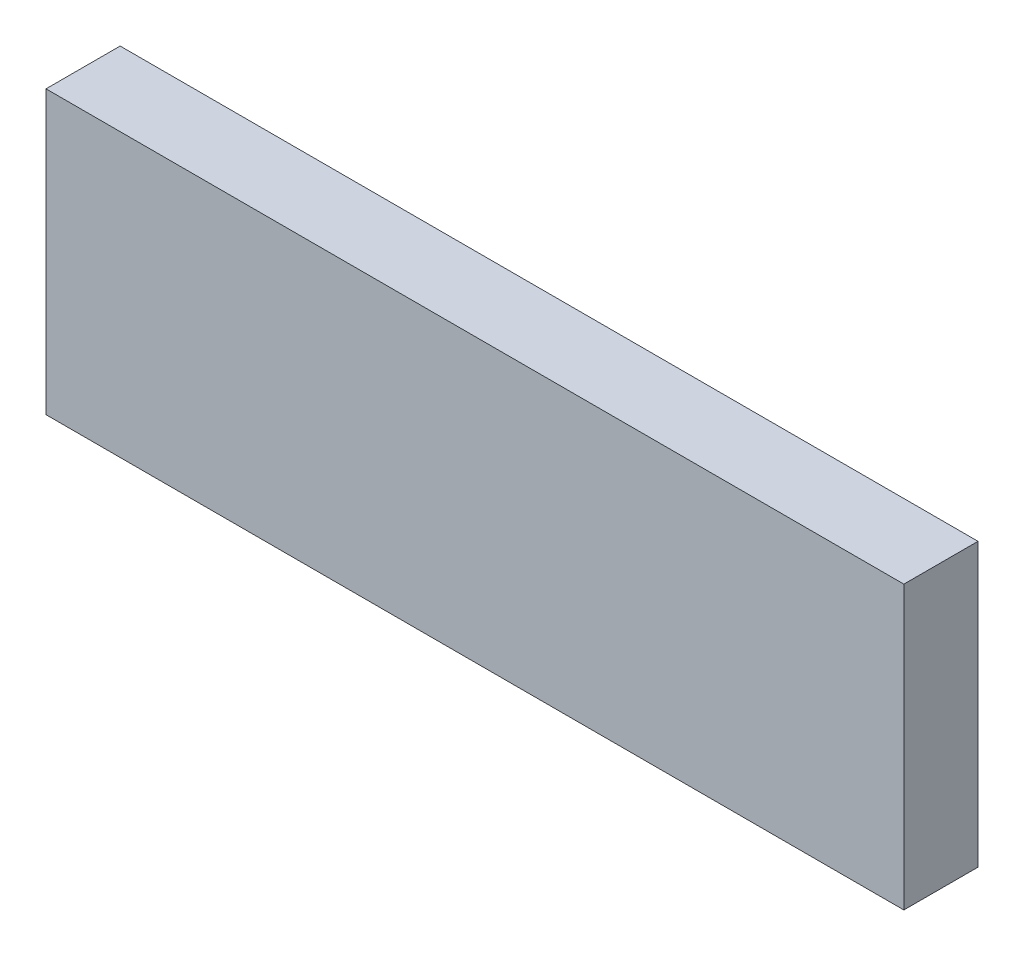
ISO-10303-21;
HEADER;
FILE_DESCRIPTION(('STEP AP214'),'2;1');
FILE_NAME('part.step','',(''),(''),'','','');
FILE_SCHEMA(('AUTOMOTIVE_DESIGN { 1 0 10303 214 1 1 1 1 }'));
ENDSEC;
DATA;
#1=APPLICATION_CONTEXT('core data for automotive mechanical design processes');
#2=APPLICATION_PROTOCOL_DEFINITION('international standard','automotive_design',2000,#1);
#3=PRODUCT_CONTEXT('',#1,'mechanical');
#4=PRODUCT('Part','Part','',(#3));
#5=PRODUCT_RELATED_PRODUCT_CATEGORY('part','',(#4));
#6=PRODUCT_DEFINITION_FORMATION('','',#4);
#7=PRODUCT_DEFINITION_CONTEXT('part definition',#1,'design');
#8=PRODUCT_DEFINITION('design','',#6,#7);
#9=PRODUCT_DEFINITION_SHAPE('','',#8);
#10=(LENGTH_UNIT() NAMED_UNIT(*) SI_UNIT(.MILLI.,.METRE.));
#11=(NAMED_UNIT(*) PLANE_ANGLE_UNIT() SI_UNIT($,.RADIAN.));
#12=(NAMED_UNIT(*) SI_UNIT($,.STERADIAN.) SOLID_ANGLE_UNIT());
#13=UNCERTAINTY_MEASURE_WITH_UNIT(LENGTH_MEASURE(1.E-05),#10,'distance_accuracy_value','');
#14=(GEOMETRIC_REPRESENTATION_CONTEXT(3) GLOBAL_UNCERTAINTY_ASSIGNED_CONTEXT((#13)) GLOBAL_UNIT_ASSIGNED_CONTEXT((#10,
#11,#12)) REPRESENTATION_CONTEXT('',''));
#15=CARTESIAN_POINT('',(0.,0.,0.));
#16=DIRECTION('',(0.,0.,1.));
#17=DIRECTION('',(1.,0.,0.));
#18=AXIS2_PLACEMENT_3D('',#15,#16,#17);
#19=CARTESIAN_POINT('',(-112.34,36.9570000000001,258.48464725068));
#20=DIRECTION('',(1.,0.,0.));
#21=DIRECTION('',(0.,0.,-1.));
#22=AXIS2_PLACEMENT_3D('',#19,#20,#21);
#23=PLANE('',#22);
#24=DIRECTION('',(0.,-1.,0.));
#25=VECTOR('',#24,1.);
#26=CARTESIAN_POINT('',(-112.34,36.9570000000001,19.419000024));
#27=LINE('',#26,#25);
#28=CARTESIAN_POINT('',(-112.34,36.9570000000001,19.419000024));
#29=VERTEX_POINT('',#28);
#30=CARTESIAN_POINT('',(-112.34,-36.9570000000001,19.419000024));
#31=VERTEX_POINT('',#30);
#32=EDGE_CURVE('E83',#29,#31,#27,.T.);
#33=ORIENTED_EDGE('',*,*,#32,.F.);
#34=DIRECTION('',(0.,0.,-1.));
#35=VECTOR('',#34,1.);
#36=CARTESIAN_POINT('',(-112.34,36.9570000000001,258.48464725068));
#37=LINE('',#36,#35);
#38=CARTESIAN_POINT('',(-112.34,36.9570000000001,0.));
#39=VERTEX_POINT('',#38);
#40=EDGE_CURVE('E37',#29,#39,#37,.T.);
#41=ORIENTED_EDGE('',*,*,#40,.T.);
#42=DIRECTION('',(0.,-1.,0.));
#43=VECTOR('',#42,1.);
#44=CARTESIAN_POINT('',(-112.34,36.9570000000001,0.));
#45=LINE('',#44,#43);
#46=CARTESIAN_POINT('',(-112.34,-36.9570000000001,0.));
#47=VERTEX_POINT('',#46);
#48=EDGE_CURVE('E81',#39,#47,#45,.T.);
#49=ORIENTED_EDGE('',*,*,#48,.T.);
#50=DIRECTION('',(0.,0.,-1.));
#51=VECTOR('',#50,1.);
#52=CARTESIAN_POINT('',(-112.34,-36.9570000000001,258.48464725068));
#53=LINE('',#52,#51);
#54=EDGE_CURVE('E72',#31,#47,#53,.T.);
#55=ORIENTED_EDGE('',*,*,#54,.F.);
#56=EDGE_LOOP('',(#33,#41,#49,#55));
#57=FACE_BOUND('',#56,.T.);
#58=ADVANCED_FACE('F33',(#57),#23,.F.);
#59=CARTESIAN_POINT('',(-112.34,-36.9570000000001,258.48464725068));
#60=DIRECTION('',(0.,1.,0.));
#61=DIRECTION('',(0.,0.,1.));
#62=AXIS2_PLACEMENT_3D('',#59,#60,#61);
#63=PLANE('',#62);
#64=DIRECTION('',(1.,0.,0.));
#65=VECTOR('',#64,1.);
#66=CARTESIAN_POINT('',(-112.34,-36.9570000000001,19.419000024));
#67=LINE('',#66,#65);
#68=CARTESIAN_POINT('',(112.34,-36.9570000000001,19.419000024));
#69=VERTEX_POINT('',#68);
#70=EDGE_CURVE('E42',#31,#69,#67,.T.);
#71=ORIENTED_EDGE('',*,*,#70,.F.);
#72=ORIENTED_EDGE('',*,*,#54,.T.);
#73=DIRECTION('',(1.,0.,0.));
#74=VECTOR('',#73,1.);
#75=CARTESIAN_POINT('',(-112.34,-36.9570000000001,0.));
#76=LINE('',#75,#74);
#77=CARTESIAN_POINT('',(112.34,-36.9570000000001,0.));
#78=VERTEX_POINT('',#77);
#79=EDGE_CURVE('E93',#47,#78,#76,.T.);
#80=ORIENTED_EDGE('',*,*,#79,.T.);
#81=DIRECTION('',(0.,0.,-1.));
#82=VECTOR('',#81,1.);
#83=CARTESIAN_POINT('',(112.34,-36.9570000000001,258.48464725068));
#84=LINE('',#83,#82);
#85=EDGE_CURVE('E102',#69,#78,#84,.T.);
#86=ORIENTED_EDGE('',*,*,#85,.F.);
#87=EDGE_LOOP('',(#71,#72,#80,#86));
#88=FACE_BOUND('',#87,.T.);
#89=ADVANCED_FACE('F106',(#88),#63,.F.);
#90=CARTESIAN_POINT('',(112.34,36.9570000000001,258.48464725068));
#91=DIRECTION('',(-1.,0.,0.));
#92=DIRECTION('',(0.,0.,1.));
#93=AXIS2_PLACEMENT_3D('',#90,#91,#92);
#94=PLANE('',#93);
#95=DIRECTION('',(0.,1.,0.));
#96=VECTOR('',#95,1.);
#97=CARTESIAN_POINT('',(112.34,36.9570000000001,19.419000024));
#98=LINE('',#97,#96);
#99=CARTESIAN_POINT('',(112.34,36.9570000000001,19.419000024));
#100=VERTEX_POINT('',#99);
#101=EDGE_CURVE('E11',#69,#100,#98,.T.);
#102=ORIENTED_EDGE('',*,*,#101,.F.);
#103=ORIENTED_EDGE('',*,*,#85,.T.);
#104=DIRECTION('',(0.,1.,0.));
#105=VECTOR('',#104,1.);
#106=CARTESIAN_POINT('',(112.34,36.9570000000001,0.));
#107=LINE('',#106,#105);
#108=CARTESIAN_POINT('',(112.34,36.9570000000001,0.));
#109=VERTEX_POINT('',#108);
#110=EDGE_CURVE('E103',#78,#109,#107,.T.);
#111=ORIENTED_EDGE('',*,*,#110,.T.);
#112=DIRECTION('',(0.,0.,-1.));
#113=VECTOR('',#112,1.);
#114=CARTESIAN_POINT('',(112.34,36.9570000000001,258.48464725068));
#115=LINE('',#114,#113);
#116=EDGE_CURVE('E55',#100,#109,#115,.T.);
#117=ORIENTED_EDGE('',*,*,#116,.F.);
#118=EDGE_LOOP('',(#102,#103,#111,#117));
#119=FACE_BOUND('',#118,.T.);
#120=ADVANCED_FACE('F105',(#119),#94,.F.);
#121=CARTESIAN_POINT('',(-112.34,36.9570000000001,258.48464725068));
#122=DIRECTION('',(0.,-1.,0.));
#123=DIRECTION('',(0.,0.,-1.));
#124=AXIS2_PLACEMENT_3D('',#121,#122,#123);
#125=PLANE('',#124);
#126=DIRECTION('',(-1.,0.,0.));
#127=VECTOR('',#126,1.);
#128=CARTESIAN_POINT('',(-112.34,36.9570000000001,19.419000024));
#129=LINE('',#128,#127);
#130=EDGE_CURVE('E90',#100,#29,#129,.T.);
#131=ORIENTED_EDGE('',*,*,#130,.F.);
#132=ORIENTED_EDGE('',*,*,#116,.T.);
#133=DIRECTION('',(-1.,0.,0.));
#134=VECTOR('',#133,1.);
#135=CARTESIAN_POINT('',(-112.34,36.9570000000001,0.));
#136=LINE('',#135,#134);
#137=EDGE_CURVE('E86',#109,#39,#136,.T.);
#138=ORIENTED_EDGE('',*,*,#137,.T.);
#139=ORIENTED_EDGE('',*,*,#40,.F.);
#140=EDGE_LOOP('',(#131,#132,#138,#139));
#141=FACE_BOUND('',#140,.T.);
#142=ADVANCED_FACE('F87',(#141),#125,.F.);
#143=CARTESIAN_POINT('',(0.,0.,0.));
#144=DIRECTION('',(0.,0.,1.));
#145=DIRECTION('',(1.,0.,0.));
#146=AXIS2_PLACEMENT_3D('',#143,#144,#145);
#147=PLANE('',#146);
#148=ORIENTED_EDGE('',*,*,#48,.F.);
#149=ORIENTED_EDGE('',*,*,#137,.F.);
#150=ORIENTED_EDGE('',*,*,#110,.F.);
#151=ORIENTED_EDGE('',*,*,#79,.F.);
#152=EDGE_LOOP('',(#148,#149,#150,#151));
#153=FACE_BOUND('',#152,.T.);
#154=ADVANCED_FACE('F92',(#153),#147,.F.);
#155=CARTESIAN_POINT('',(-160.020025460753,0.,19.419000024));
#156=DIRECTION('',(0.,0.,1.));
#157=DIRECTION('',(1.,0.,0.));
#158=AXIS2_PLACEMENT_3D('',#155,#156,#157);
#159=PLANE('',#158);
#160=ORIENTED_EDGE('',*,*,#130,.T.);
#161=ORIENTED_EDGE('',*,*,#32,.T.);
#162=ORIENTED_EDGE('',*,*,#70,.T.);
#163=ORIENTED_EDGE('',*,*,#101,.T.);
#164=EDGE_LOOP('',(#160,#161,#162,#163));
#165=FACE_BOUND('',#164,.T.);
#166=ADVANCED_FACE('F35',(#165),#159,.T.);
#167=CLOSED_SHELL('',(#58,#89,#120,#142,#154,#166));
#168=MANIFOLD_SOLID_BREP('B2',#167);
#169=ADVANCED_BREP_SHAPE_REPRESENTATION('',(#18,#168),#14);
#170=SHAPE_DEFINITION_REPRESENTATION(#9,#169);
ENDSEC;
END-ISO-10303-21;
